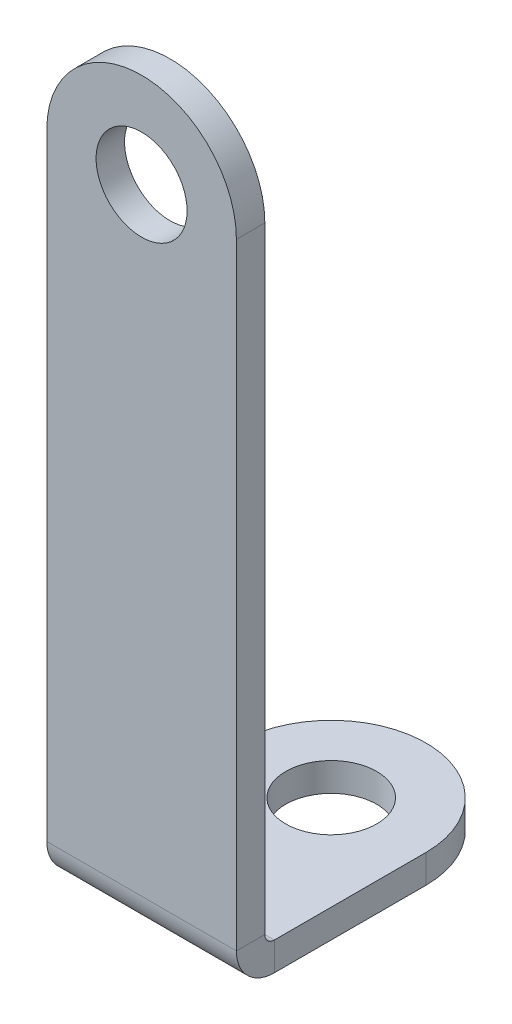
ISO-10303-21;
HEADER;
FILE_DESCRIPTION(('STEP AP214'),'2;1');
FILE_NAME('part.step','',(''),(''),'','','');
FILE_SCHEMA(('AUTOMOTIVE_DESIGN { 1 0 10303 214 1 1 1 1 }'));
ENDSEC;
DATA;
#1=APPLICATION_CONTEXT('core data for automotive mechanical design processes');
#2=APPLICATION_PROTOCOL_DEFINITION('international standard','automotive_design',2000,#1);
#3=PRODUCT_CONTEXT('',#1,'mechanical');
#4=PRODUCT('Part','Part','',(#3));
#5=PRODUCT_RELATED_PRODUCT_CATEGORY('part','',(#4));
#6=PRODUCT_DEFINITION_FORMATION('','',#4);
#7=PRODUCT_DEFINITION_CONTEXT('part definition',#1,'design');
#8=PRODUCT_DEFINITION('design','',#6,#7);
#9=PRODUCT_DEFINITION_SHAPE('','',#8);
#10=(LENGTH_UNIT() NAMED_UNIT(*) SI_UNIT(.MILLI.,.METRE.));
#11=(NAMED_UNIT(*) PLANE_ANGLE_UNIT() SI_UNIT($,.RADIAN.));
#12=(NAMED_UNIT(*) SI_UNIT($,.STERADIAN.) SOLID_ANGLE_UNIT());
#13=UNCERTAINTY_MEASURE_WITH_UNIT(LENGTH_MEASURE(1.E-05),#10,'distance_accuracy_value','');
#14=(GEOMETRIC_REPRESENTATION_CONTEXT(3) GLOBAL_UNCERTAINTY_ASSIGNED_CONTEXT((#13)) GLOBAL_UNIT_ASSIGNED_CONTEXT((#10,
#11,#12)) REPRESENTATION_CONTEXT('',''));
#15=CARTESIAN_POINT('',(0.,0.,0.));
#16=DIRECTION('',(0.,0.,1.));
#17=DIRECTION('',(1.,0.,0.));
#18=AXIS2_PLACEMENT_3D('',#15,#16,#17);
#19=CARTESIAN_POINT('',(0.,17.25,0.));
#20=DIRECTION('',(0.,0.,-1.));
#21=DIRECTION('',(-1.,0.,0.));
#22=AXIS2_PLACEMENT_3D('',#19,#20,#21);
#23=CYLINDRICAL_SURFACE('',#22,2.5);
#24=DIRECTION('',(0.,0.,1.));
#25=VECTOR('',#24,1.);
#26=CARTESIAN_POINT('',(-2.5,17.25,0.));
#27=LINE('',#26,#25);
#28=CARTESIAN_POINT('',(-2.5,17.25,0.));
#29=VERTEX_POINT('',#28);
#30=CARTESIAN_POINT('',(-2.5,17.25,-0.75));
#31=VERTEX_POINT('',#30);
#32=EDGE_CURVE('E216',#29,#31,#27,.F.);
#33=ORIENTED_EDGE('',*,*,#32,.F.);
#34=CARTESIAN_POINT('',(0.,17.25,0.));
#35=DIRECTION('',(0.,0.,-1.));
#36=DIRECTION('',(0.,1.,0.));
#37=AXIS2_PLACEMENT_3D('',#34,#35,#36);
#38=CIRCLE('',#37,2.5);
#39=CARTESIAN_POINT('',(2.5,17.25,0.));
#40=VERTEX_POINT('',#39);
#41=EDGE_CURVE('E57',#40,#29,#38,.F.);
#42=ORIENTED_EDGE('',*,*,#41,.F.);
#43=DIRECTION('',(0.,0.,-1.));
#44=VECTOR('',#43,1.);
#45=CARTESIAN_POINT('',(2.5,17.25,-1.));
#46=LINE('',#45,#44);
#47=CARTESIAN_POINT('',(2.5,17.25,-0.75));
#48=VERTEX_POINT('',#47);
#49=EDGE_CURVE('E220',#48,#40,#46,.F.);
#50=ORIENTED_EDGE('',*,*,#49,.F.);
#51=CARTESIAN_POINT('',(0.,17.25,-0.75));
#52=DIRECTION('',(0.,0.,-1.));
#53=DIRECTION('',(0.,1.,0.));
#54=AXIS2_PLACEMENT_3D('',#51,#52,#53);
#55=CIRCLE('',#54,2.5);
#56=EDGE_CURVE('E11',#31,#48,#55,.T.);
#57=ORIENTED_EDGE('',*,*,#56,.F.);
#58=EDGE_LOOP('',(#33,#42,#50,#57));
#59=FACE_BOUND('',#58,.T.);
#60=ADVANCED_FACE('F48',(#59),#23,.T.);
#61=CARTESIAN_POINT('',(0.,0.,-5.));
#62=DIRECTION('',(0.,-1.,0.));
#63=DIRECTION('',(0.,0.,-1.));
#64=AXIS2_PLACEMENT_3D('',#61,#62,#63);
#65=CYLINDRICAL_SURFACE('',#64,2.5);
#66=DIRECTION('',(0.,-1.,0.));
#67=VECTOR('',#66,1.);
#68=CARTESIAN_POINT('',(2.5,1.,-5.));
#69=LINE('',#68,#67);
#70=CARTESIAN_POINT('',(2.5,0.,-5.));
#71=VERTEX_POINT('',#70);
#72=CARTESIAN_POINT('',(2.5,0.75,-5.));
#73=VERTEX_POINT('',#72);
#74=EDGE_CURVE('E146',#71,#73,#69,.F.);
#75=ORIENTED_EDGE('',*,*,#74,.F.);
#76=CARTESIAN_POINT('',(0.,0.,-5.));
#77=DIRECTION('',(0.,1.,0.));
#78=DIRECTION('',(0.,0.,1.));
#79=AXIS2_PLACEMENT_3D('',#76,#77,#78);
#80=CIRCLE('',#79,2.5);
#81=CARTESIAN_POINT('',(-2.5,0.,-5.));
#82=VERTEX_POINT('',#81);
#83=EDGE_CURVE('E210',#82,#71,#80,.F.);
#84=ORIENTED_EDGE('',*,*,#83,.F.);
#85=DIRECTION('',(0.,-1.,0.));
#86=VECTOR('',#85,1.);
#87=CARTESIAN_POINT('',(-2.5,1.,-5.));
#88=LINE('',#87,#86);
#89=CARTESIAN_POINT('',(-2.5,0.75,-5.));
#90=VERTEX_POINT('',#89);
#91=EDGE_CURVE('E206',#90,#82,#88,.T.);
#92=ORIENTED_EDGE('',*,*,#91,.F.);
#93=CARTESIAN_POINT('',(0.,0.75,-5.));
#94=DIRECTION('',(0.,1.,0.));
#95=DIRECTION('',(0.,0.,1.));
#96=AXIS2_PLACEMENT_3D('',#93,#94,#95);
#97=CIRCLE('',#96,2.5);
#98=EDGE_CURVE('E213',#73,#90,#97,.T.);
#99=ORIENTED_EDGE('',*,*,#98,.F.);
#100=EDGE_LOOP('',(#75,#84,#92,#99));
#101=FACE_BOUND('',#100,.T.);
#102=ADVANCED_FACE('F279',(#101),#65,.T.);
#103=CARTESIAN_POINT('',(2.5,1.,0.));
#104=DIRECTION('',(1.,0.,0.));
#105=DIRECTION('',(0.,0.,-1.));
#106=AXIS2_PLACEMENT_3D('',#103,#104,#105);
#107=PLANE('',#106);
#108=DIRECTION('',(0.,0.,-1.));
#109=VECTOR('',#108,1.);
#110=CARTESIAN_POINT('',(2.5,1.,0.));
#111=LINE('',#110,#109);
#112=CARTESIAN_POINT('',(2.5,1.,0.));
#113=VERTEX_POINT('',#112);
#114=CARTESIAN_POINT('',(2.5,1.,-0.75));
#115=VERTEX_POINT('',#114);
#116=EDGE_CURVE('E124',#113,#115,#111,.T.);
#117=ORIENTED_EDGE('',*,*,#116,.F.);
#118=CARTESIAN_POINT('',(2.5,1.,-1.));
#119=DIRECTION('',(-1.,0.,0.));
#120=DIRECTION('',(0.,0.,1.));
#121=AXIS2_PLACEMENT_3D('',#118,#119,#120);
#122=CIRCLE('',#121,1.);
#123=CARTESIAN_POINT('',(2.5,0.,-1.));
#124=VERTEX_POINT('',#123);
#125=EDGE_CURVE('E118',#113,#124,#122,.F.);
#126=ORIENTED_EDGE('',*,*,#125,.T.);
#127=DIRECTION('',(0.,-1.,0.));
#128=VECTOR('',#127,1.);
#129=CARTESIAN_POINT('',(2.5,0.75,-1.));
#130=LINE('',#129,#128);
#131=CARTESIAN_POINT('',(2.5,0.75,-1.));
#132=VERTEX_POINT('',#131);
#133=EDGE_CURVE('E111',#132,#124,#130,.T.);
#134=ORIENTED_EDGE('',*,*,#133,.F.);
#135=CARTESIAN_POINT('',(2.5,1.,-1.));
#136=DIRECTION('',(1.,0.,0.));
#137=DIRECTION('',(0.,0.,-1.));
#138=AXIS2_PLACEMENT_3D('',#135,#136,#137);
#139=CIRCLE('',#138,0.25);
#140=EDGE_CURVE('E116',#115,#132,#139,.T.);
#141=ORIENTED_EDGE('',*,*,#140,.F.);
#142=EDGE_LOOP('',(#117,#126,#134,#141));
#143=FACE_BOUND('',#142,.T.);
#144=ADVANCED_FACE('F114',(#143),#107,.T.);
#145=CARTESIAN_POINT('',(2.5,0.75,-1.));
#146=DIRECTION('',(1.,0.,0.));
#147=DIRECTION('',(0.,0.,-1.));
#148=AXIS2_PLACEMENT_3D('',#145,#146,#147);
#149=PLANE('',#148);
#150=DIRECTION('',(0.,-1.,0.));
#151=VECTOR('',#150,1.);
#152=CARTESIAN_POINT('',(2.5,19.75,-0.75));
#153=LINE('',#152,#151);
#154=EDGE_CURVE('E154',#48,#115,#153,.T.);
#155=ORIENTED_EDGE('',*,*,#154,.F.);
#156=ORIENTED_EDGE('',*,*,#49,.T.);
#157=DIRECTION('',(0.,-1.,0.));
#158=VECTOR('',#157,1.);
#159=CARTESIAN_POINT('',(2.5,19.75,0.));
#160=LINE('',#159,#158);
#161=EDGE_CURVE('E158',#40,#113,#160,.T.);
#162=ORIENTED_EDGE('',*,*,#161,.T.);
#163=ORIENTED_EDGE('',*,*,#116,.T.);
#164=EDGE_LOOP('',(#155,#156,#162,#163));
#165=FACE_BOUND('',#164,.T.);
#166=ADVANCED_FACE('F288',(#165),#149,.T.);
#167=CARTESIAN_POINT('',(-2.5,0.,-1.));
#168=DIRECTION('',(-1.,0.,0.));
#169=DIRECTION('',(0.,0.,1.));
#170=AXIS2_PLACEMENT_3D('',#167,#168,#169);
#171=PLANE('',#170);
#172=DIRECTION('',(0.,1.,0.));
#173=VECTOR('',#172,1.);
#174=CARTESIAN_POINT('',(-2.5,0.,-1.));
#175=LINE('',#174,#173);
#176=CARTESIAN_POINT('',(-2.5,0.,-1.));
#177=VERTEX_POINT('',#176);
#178=CARTESIAN_POINT('',(-2.5,0.75,-1.));
#179=VERTEX_POINT('',#178);
#180=EDGE_CURVE('E125',#177,#179,#175,.T.);
#181=ORIENTED_EDGE('',*,*,#180,.F.);
#182=CARTESIAN_POINT('',(-2.5,1.,-1.));
#183=DIRECTION('',(-1.,0.,0.));
#184=DIRECTION('',(0.,0.,1.));
#185=AXIS2_PLACEMENT_3D('',#182,#183,#184);
#186=CIRCLE('',#185,1.);
#187=CARTESIAN_POINT('',(-2.5,1.,0.));
#188=VERTEX_POINT('',#187);
#189=EDGE_CURVE('E183',#188,#177,#186,.F.);
#190=ORIENTED_EDGE('',*,*,#189,.F.);
#191=DIRECTION('',(0.,0.,1.));
#192=VECTOR('',#191,1.);
#193=CARTESIAN_POINT('',(-2.5,1.,-0.75));
#194=LINE('',#193,#192);
#195=CARTESIAN_POINT('',(-2.5,1.,-0.75));
#196=VERTEX_POINT('',#195);
#197=EDGE_CURVE('E140',#196,#188,#194,.T.);
#198=ORIENTED_EDGE('',*,*,#197,.F.);
#199=CARTESIAN_POINT('',(-2.5,1.,-1.));
#200=DIRECTION('',(1.,0.,0.));
#201=DIRECTION('',(0.,0.,-1.));
#202=AXIS2_PLACEMENT_3D('',#199,#200,#201);
#203=CIRCLE('',#202,0.25);
#204=EDGE_CURVE('E174',#196,#179,#203,.T.);
#205=ORIENTED_EDGE('',*,*,#204,.T.);
#206=EDGE_LOOP('',(#181,#190,#198,#205));
#207=FACE_BOUND('',#206,.T.);
#208=ADVANCED_FACE('F236',(#207),#171,.T.);
#209=CARTESIAN_POINT('',(-2.5,1.,-0.75));
#210=DIRECTION('',(-1.,0.,0.));
#211=DIRECTION('',(0.,0.,1.));
#212=AXIS2_PLACEMENT_3D('',#209,#210,#211);
#213=PLANE('',#212);
#214=DIRECTION('',(0.,0.,-1.));
#215=VECTOR('',#214,1.);
#216=CARTESIAN_POINT('',(-2.5,0.75,0.));
#217=LINE('',#216,#215);
#218=EDGE_CURVE('E135',#179,#90,#217,.T.);
#219=ORIENTED_EDGE('',*,*,#218,.T.);
#220=ORIENTED_EDGE('',*,*,#91,.T.);
#221=DIRECTION('',(0.,0.,-1.));
#222=VECTOR('',#221,1.);
#223=CARTESIAN_POINT('',(-2.5,0.,0.));
#224=LINE('',#223,#222);
#225=EDGE_CURVE('E167',#177,#82,#224,.T.);
#226=ORIENTED_EDGE('',*,*,#225,.F.);
#227=ORIENTED_EDGE('',*,*,#180,.T.);
#228=EDGE_LOOP('',(#219,#220,#226,#227));
#229=FACE_BOUND('',#228,.T.);
#230=ADVANCED_FACE('F239',(#229),#213,.T.);
#231=CARTESIAN_POINT('',(2.5,0.,0.));
#232=DIRECTION('',(0.,1.,0.));
#233=DIRECTION('',(0.,0.,1.));
#234=AXIS2_PLACEMENT_3D('',#231,#232,#233);
#235=PLANE('',#234);
#236=CARTESIAN_POINT('',(0.,0.,-5.));
#237=DIRECTION('',(0.,1.,0.));
#238=DIRECTION('',(0.,0.,1.));
#239=AXIS2_PLACEMENT_3D('',#236,#237,#238);
#240=CIRCLE('',#239,1.19999999999999);
#241=CARTESIAN_POINT('',(0.,0.,-3.80000000000001));
#242=VERTEX_POINT('',#241);
#243=EDGE_CURVE('E254',#242,#242,#240,.T.);
#244=ORIENTED_EDGE('',*,*,#243,.T.);
#245=EDGE_LOOP('',(#244));
#246=FACE_BOUND('',#245,.T.);
#247=ORIENTED_EDGE('',*,*,#225,.T.);
#248=ORIENTED_EDGE('',*,*,#83,.T.);
#249=DIRECTION('',(0.,0.,-1.));
#250=VECTOR('',#249,1.);
#251=CARTESIAN_POINT('',(2.5,0.,0.));
#252=LINE('',#251,#250);
#253=EDGE_CURVE('E148',#124,#71,#252,.T.);
#254=ORIENTED_EDGE('',*,*,#253,.F.);
#255=DIRECTION('',(-1.,0.,0.));
#256=VECTOR('',#255,1.);
#257=CARTESIAN_POINT('',(2.5,0.,-1.));
#258=LINE('',#257,#256);
#259=EDGE_CURVE('E166',#124,#177,#258,.T.);
#260=ORIENTED_EDGE('',*,*,#259,.T.);
#261=EDGE_LOOP('',(#247,#248,#254,#260));
#262=FACE_BOUND('',#261,.T.);
#263=ADVANCED_FACE('F242',(#246,#262),#235,.F.);
#264=CARTESIAN_POINT('',(2.5,0.75,0.));
#265=DIRECTION('',(0.,1.,0.));
#266=DIRECTION('',(0.,0.,1.));
#267=AXIS2_PLACEMENT_3D('',#264,#265,#266);
#268=PLANE('',#267);
#269=CARTESIAN_POINT('',(0.,0.750000000000001,-5.));
#270=DIRECTION('',(0.,1.,0.));
#271=DIRECTION('',(0.,0.,1.));
#272=AXIS2_PLACEMENT_3D('',#269,#270,#271);
#273=CIRCLE('',#272,1.19999999999999);
#274=CARTESIAN_POINT('',(0.,0.750000000000001,-3.80000000000001));
#275=VERTEX_POINT('',#274);
#276=EDGE_CURVE('E258',#275,#275,#273,.T.);
#277=ORIENTED_EDGE('',*,*,#276,.F.);
#278=EDGE_LOOP('',(#277));
#279=FACE_BOUND('',#278,.T.);
#280=DIRECTION('',(0.,0.,-1.));
#281=VECTOR('',#280,1.);
#282=CARTESIAN_POINT('',(2.5,0.75,0.));
#283=LINE('',#282,#281);
#284=EDGE_CURVE('E133',#132,#73,#283,.T.);
#285=ORIENTED_EDGE('',*,*,#284,.T.);
#286=ORIENTED_EDGE('',*,*,#98,.T.);
#287=ORIENTED_EDGE('',*,*,#218,.F.);
#288=DIRECTION('',(-1.,0.,0.));
#289=VECTOR('',#288,1.);
#290=CARTESIAN_POINT('',(2.5,0.75,-1.));
#291=LINE('',#290,#289);
#292=EDGE_CURVE('E131',#132,#179,#291,.T.);
#293=ORIENTED_EDGE('',*,*,#292,.F.);
#294=EDGE_LOOP('',(#285,#286,#287,#293));
#295=FACE_BOUND('',#294,.T.);
#296=ADVANCED_FACE('F132',(#279,#295),#268,.T.);
#297=CARTESIAN_POINT('',(2.5,1.,-1.));
#298=DIRECTION('',(-1.,0.,0.));
#299=DIRECTION('',(0.,0.,1.));
#300=AXIS2_PLACEMENT_3D('',#297,#298,#299);
#301=CYLINDRICAL_SURFACE('',#300,0.25);
#302=ORIENTED_EDGE('',*,*,#204,.F.);
#303=DIRECTION('',(-1.,0.,0.));
#304=VECTOR('',#303,1.);
#305=CARTESIAN_POINT('',(2.5,1.,-0.75));
#306=LINE('',#305,#304);
#307=EDGE_CURVE('E141',#115,#196,#306,.T.);
#308=ORIENTED_EDGE('',*,*,#307,.F.);
#309=ORIENTED_EDGE('',*,*,#140,.T.);
#310=ORIENTED_EDGE('',*,*,#292,.T.);
#311=EDGE_LOOP('',(#302,#308,#309,#310));
#312=FACE_BOUND('',#311,.T.);
#313=ADVANCED_FACE('F151',(#312),#301,.F.);
#314=CARTESIAN_POINT('',(2.5,19.75,-0.75));
#315=DIRECTION('',(0.,0.,-1.));
#316=DIRECTION('',(0.,1.,0.));
#317=AXIS2_PLACEMENT_3D('',#314,#315,#316);
#318=PLANE('',#317);
#319=CARTESIAN_POINT('',(0.,17.25,-0.75));
#320=DIRECTION('',(0.,0.,-1.));
#321=DIRECTION('',(0.,1.,0.));
#322=AXIS2_PLACEMENT_3D('',#319,#320,#321);
#323=CIRCLE('',#322,1.19999999999999);
#324=CARTESIAN_POINT('',(0.,18.45,-0.75));
#325=VERTEX_POINT('',#324);
#326=EDGE_CURVE('E171',#325,#325,#323,.T.);
#327=ORIENTED_EDGE('',*,*,#326,.F.);
#328=EDGE_LOOP('',(#327));
#329=FACE_BOUND('',#328,.T.);
#330=DIRECTION('',(0.,-1.,0.));
#331=VECTOR('',#330,1.);
#332=CARTESIAN_POINT('',(-2.5,19.75,-0.75));
#333=LINE('',#332,#331);
#334=EDGE_CURVE('E177',#31,#196,#333,.T.);
#335=ORIENTED_EDGE('',*,*,#334,.F.);
#336=ORIENTED_EDGE('',*,*,#56,.T.);
#337=ORIENTED_EDGE('',*,*,#154,.T.);
#338=ORIENTED_EDGE('',*,*,#307,.T.);
#339=EDGE_LOOP('',(#335,#336,#337,#338));
#340=FACE_BOUND('',#339,.T.);
#341=ADVANCED_FACE('F274',(#329,#340),#318,.T.);
#342=CARTESIAN_POINT('',(2.5,19.75,0.));
#343=DIRECTION('',(0.,0.,-1.));
#344=DIRECTION('',(0.,1.,0.));
#345=AXIS2_PLACEMENT_3D('',#342,#343,#344);
#346=PLANE('',#345);
#347=CARTESIAN_POINT('',(0.,17.25,0.));
#348=DIRECTION('',(0.,0.,1.));
#349=DIRECTION('',(1.,0.,0.));
#350=AXIS2_PLACEMENT_3D('',#347,#348,#349);
#351=CIRCLE('',#350,1.19999999999999);
#352=CARTESIAN_POINT('',(1.19999999999999,17.25,0.));
#353=VERTEX_POINT('',#352);
#354=EDGE_CURVE('E250',#353,#353,#351,.T.);
#355=ORIENTED_EDGE('',*,*,#354,.F.);
#356=EDGE_LOOP('',(#355));
#357=FACE_BOUND('',#356,.T.);
#358=ORIENTED_EDGE('',*,*,#161,.F.);
#359=ORIENTED_EDGE('',*,*,#41,.T.);
#360=DIRECTION('',(0.,-1.,0.));
#361=VECTOR('',#360,1.);
#362=CARTESIAN_POINT('',(-2.5,19.75,0.));
#363=LINE('',#362,#361);
#364=EDGE_CURVE('E180',#29,#188,#363,.T.);
#365=ORIENTED_EDGE('',*,*,#364,.T.);
#366=DIRECTION('',(-1.,0.,0.));
#367=VECTOR('',#366,1.);
#368=CARTESIAN_POINT('',(2.5,1.,0.));
#369=LINE('',#368,#367);
#370=EDGE_CURVE('E190',#113,#188,#369,.T.);
#371=ORIENTED_EDGE('',*,*,#370,.F.);
#372=EDGE_LOOP('',(#358,#359,#365,#371));
#373=FACE_BOUND('',#372,.T.);
#374=ADVANCED_FACE('F226',(#357,#373),#346,.F.);
#375=CARTESIAN_POINT('',(2.5,1.,-1.));
#376=DIRECTION('',(-1.,0.,0.));
#377=DIRECTION('',(0.,0.,1.));
#378=AXIS2_PLACEMENT_3D('',#375,#376,#377);
#379=CYLINDRICAL_SURFACE('',#378,1.);
#380=ORIENTED_EDGE('',*,*,#189,.T.);
#381=ORIENTED_EDGE('',*,*,#259,.F.);
#382=ORIENTED_EDGE('',*,*,#125,.F.);
#383=ORIENTED_EDGE('',*,*,#370,.T.);
#384=EDGE_LOOP('',(#380,#381,#382,#383));
#385=FACE_BOUND('',#384,.T.);
#386=ADVANCED_FACE('F235',(#385),#379,.T.);
#387=CARTESIAN_POINT('',(2.5,1.,-1.));
#388=DIRECTION('',(1.,0.,0.));
#389=DIRECTION('',(0.,0.,-1.));
#390=AXIS2_PLACEMENT_3D('',#387,#388,#389);
#391=PLANE('',#390);
#392=ORIENTED_EDGE('',*,*,#253,.T.);
#393=ORIENTED_EDGE('',*,*,#74,.T.);
#394=ORIENTED_EDGE('',*,*,#284,.F.);
#395=ORIENTED_EDGE('',*,*,#133,.T.);
#396=EDGE_LOOP('',(#392,#393,#394,#395));
#397=FACE_BOUND('',#396,.T.);
#398=ADVANCED_FACE('F144',(#397),#391,.T.);
#399=CARTESIAN_POINT('',(-2.5,1.,-1.));
#400=DIRECTION('',(1.,0.,0.));
#401=DIRECTION('',(0.,0.,-1.));
#402=AXIS2_PLACEMENT_3D('',#399,#400,#401);
#403=PLANE('',#402);
#404=ORIENTED_EDGE('',*,*,#364,.F.);
#405=ORIENTED_EDGE('',*,*,#32,.T.);
#406=ORIENTED_EDGE('',*,*,#334,.T.);
#407=ORIENTED_EDGE('',*,*,#197,.T.);
#408=EDGE_LOOP('',(#404,#405,#406,#407));
#409=FACE_BOUND('',#408,.T.);
#410=ADVANCED_FACE('F230',(#409),#403,.F.);
#411=CARTESIAN_POINT('',(0.,17.25,0.));
#412=DIRECTION('',(0.,0.,1.));
#413=DIRECTION('',(1.,0.,0.));
#414=AXIS2_PLACEMENT_3D('',#411,#412,#413);
#415=CYLINDRICAL_SURFACE('',#414,1.19999999999999);
#416=ORIENTED_EDGE('',*,*,#326,.T.);
#417=EDGE_LOOP('',(#416));
#418=FACE_BOUND('',#417,.T.);
#419=ORIENTED_EDGE('',*,*,#354,.T.);
#420=EDGE_LOOP('',(#419));
#421=FACE_BOUND('',#420,.T.);
#422=ADVANCED_FACE('F333',(#418,#421),#415,.F.);
#423=CARTESIAN_POINT('',(0.,0.75,-5.));
#424=DIRECTION('',(0.,1.,0.));
#425=DIRECTION('',(0.,0.,1.));
#426=AXIS2_PLACEMENT_3D('',#423,#424,#425);
#427=CYLINDRICAL_SURFACE('',#426,1.19999999999999);
#428=ORIENTED_EDGE('',*,*,#276,.T.);
#429=EDGE_LOOP('',(#428));
#430=FACE_BOUND('',#429,.T.);
#431=ORIENTED_EDGE('',*,*,#243,.F.);
#432=EDGE_LOOP('',(#431));
#433=FACE_BOUND('',#432,.T.);
#434=ADVANCED_FACE('F264',(#430,#433),#427,.F.);
#435=CLOSED_SHELL('',(#60,#102,#144,#166,#208,#230,#263,#296,#313,#341,#374,#386,#398,#410,#422,#434));
#436=MANIFOLD_SOLID_BREP('B2',#435);
#437=ADVANCED_BREP_SHAPE_REPRESENTATION('',(#18,#436),#14);
#438=SHAPE_DEFINITION_REPRESENTATION(#9,#437);
ENDSEC;
END-ISO-10303-21;
